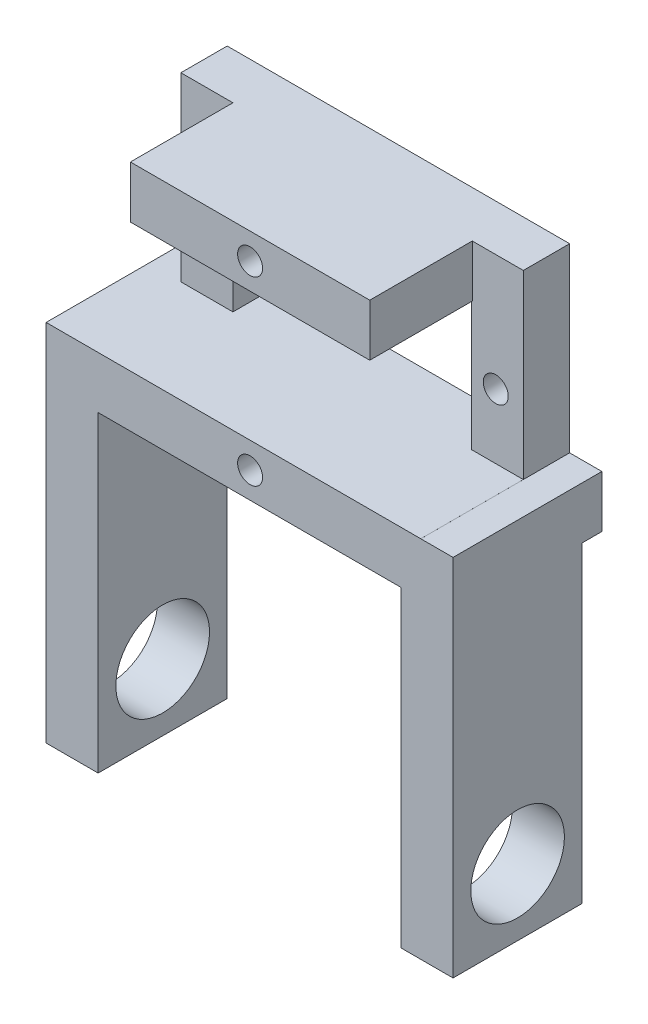
ISO-10303-21;
HEADER;
FILE_DESCRIPTION(('STEP AP214'),'2;1');
FILE_NAME('part.step','',(''),(''),'','','');
FILE_SCHEMA(('AUTOMOTIVE_DESIGN { 1 0 10303 214 1 1 1 1 }'));
ENDSEC;
DATA;
#1=APPLICATION_CONTEXT('core data for automotive mechanical design processes');
#2=APPLICATION_PROTOCOL_DEFINITION('international standard','automotive_design',2000,#1);
#3=PRODUCT_CONTEXT('',#1,'mechanical');
#4=PRODUCT('Part','Part','',(#3));
#5=PRODUCT_RELATED_PRODUCT_CATEGORY('part','',(#4));
#6=PRODUCT_DEFINITION_FORMATION('','',#4);
#7=PRODUCT_DEFINITION_CONTEXT('part definition',#1,'design');
#8=PRODUCT_DEFINITION('design','',#6,#7);
#9=PRODUCT_DEFINITION_SHAPE('','',#8);
#10=(LENGTH_UNIT() NAMED_UNIT(*) SI_UNIT(.MILLI.,.METRE.));
#11=(NAMED_UNIT(*) PLANE_ANGLE_UNIT() SI_UNIT($,.RADIAN.));
#12=(NAMED_UNIT(*) SI_UNIT($,.STERADIAN.) SOLID_ANGLE_UNIT());
#13=UNCERTAINTY_MEASURE_WITH_UNIT(LENGTH_MEASURE(1.E-05),#10,'distance_accuracy_value','');
#14=(GEOMETRIC_REPRESENTATION_CONTEXT(3) GLOBAL_UNCERTAINTY_ASSIGNED_CONTEXT((#13)) GLOBAL_UNIT_ASSIGNED_CONTEXT((#10,
#11,#12)) REPRESENTATION_CONTEXT('',''));
#15=CARTESIAN_POINT('',(0.,0.,0.));
#16=DIRECTION('',(0.,0.,1.));
#17=DIRECTION('',(1.,0.,0.));
#18=AXIS2_PLACEMENT_3D('',#15,#16,#17);
#19=CARTESIAN_POINT('',(-16.45,-11.2,5.));
#20=DIRECTION('',(0.,1.,0.));
#21=DIRECTION('',(0.,0.,1.));
#22=AXIS2_PLACEMENT_3D('',#19,#20,#21);
#23=PLANE('',#22);
#24=DIRECTION('',(0.,0.,-1.));
#25=VECTOR('',#24,1.);
#26=CARTESIAN_POINT('',(14.55,-11.2,2.45));
#27=LINE('',#26,#25);
#28=CARTESIAN_POINT('',(14.55,-11.2,14.85));
#29=VERTEX_POINT('',#28);
#30=CARTESIAN_POINT('',(14.55,-11.2,2.45));
#31=VERTEX_POINT('',#30);
#32=EDGE_CURVE('E487',#29,#31,#27,.T.);
#33=ORIENTED_EDGE('',*,*,#32,.F.);
#34=DIRECTION('',(-1.,0.,0.));
#35=VECTOR('',#34,1.);
#36=CARTESIAN_POINT('',(19.55,-11.2,14.85));
#37=LINE('',#36,#35);
#38=CARTESIAN_POINT('',(-14.55,-11.2,14.85));
#39=VERTEX_POINT('',#38);
#40=EDGE_CURVE('E371',#29,#39,#37,.T.);
#41=ORIENTED_EDGE('',*,*,#40,.T.);
#42=DIRECTION('',(0.,0.,1.));
#43=VECTOR('',#42,1.);
#44=CARTESIAN_POINT('',(-14.55,-11.2,2.45));
#45=LINE('',#44,#43);
#46=CARTESIAN_POINT('',(-14.55,-11.2,2.45));
#47=VERTEX_POINT('',#46);
#48=EDGE_CURVE('E511',#47,#39,#45,.T.);
#49=ORIENTED_EDGE('',*,*,#48,.F.);
#50=DIRECTION('',(1.,0.,0.));
#51=VECTOR('',#50,1.);
#52=CARTESIAN_POINT('',(-14.55,-11.2,2.45));
#53=LINE('',#52,#51);
#54=CARTESIAN_POINT('',(-19.55,-11.2,2.45));
#55=VERTEX_POINT('',#54);
#56=EDGE_CURVE('E505',#55,#47,#53,.T.);
#57=ORIENTED_EDGE('',*,*,#56,.F.);
#58=DIRECTION('',(0.,0.,1.));
#59=VECTOR('',#58,1.);
#60=CARTESIAN_POINT('',(-19.55,-11.2,0.));
#61=LINE('',#60,#59);
#62=CARTESIAN_POINT('',(-19.55,-11.2,0.55));
#63=VERTEX_POINT('',#62);
#64=EDGE_CURVE('E239',#63,#55,#61,.T.);
#65=ORIENTED_EDGE('',*,*,#64,.F.);
#66=DIRECTION('',(-1.,0.,0.));
#67=VECTOR('',#66,1.);
#68=CARTESIAN_POINT('',(19.55,-11.2,0.55));
#69=LINE('',#68,#67);
#70=CARTESIAN_POINT('',(19.55,-11.2,0.55));
#71=VERTEX_POINT('',#70);
#72=EDGE_CURVE('E221',#71,#63,#69,.T.);
#73=ORIENTED_EDGE('',*,*,#72,.F.);
#74=DIRECTION('',(0.,0.,-1.));
#75=VECTOR('',#74,1.);
#76=CARTESIAN_POINT('',(19.55,-11.2,17.3));
#77=LINE('',#76,#75);
#78=CARTESIAN_POINT('',(19.55,-11.2,2.45));
#79=VERTEX_POINT('',#78);
#80=EDGE_CURVE('E237',#79,#71,#77,.T.);
#81=ORIENTED_EDGE('',*,*,#80,.F.);
#82=DIRECTION('',(1.,0.,0.));
#83=VECTOR('',#82,1.);
#84=CARTESIAN_POINT('',(14.55,-11.2,2.45));
#85=LINE('',#84,#83);
#86=EDGE_CURVE('E478',#31,#79,#85,.T.);
#87=ORIENTED_EDGE('',*,*,#86,.F.);
#88=EDGE_LOOP('',(#33,#41,#49,#57,#65,#73,#81,#87));
#89=FACE_BOUND('',#88,.T.);
#90=ADVANCED_FACE('F40',(#89),#23,.F.);
#91=CARTESIAN_POINT('',(-16.45,11.2,5.));
#92=DIRECTION('',(1.,0.,0.));
#93=DIRECTION('',(0.,1.,0.));
#94=AXIS2_PLACEMENT_3D('',#91,#92,#93);
#95=PLANE('',#94);
#96=DIRECTION('',(0.,0.,-1.));
#97=VECTOR('',#96,1.);
#98=CARTESIAN_POINT('',(-16.45,11.2,5.));
#99=LINE('',#98,#97);
#100=CARTESIAN_POINT('',(-16.45,11.2,5.));
#101=VERTEX_POINT('',#100);
#102=CARTESIAN_POINT('',(-16.45,11.2,0.55));
#103=VERTEX_POINT('',#102);
#104=EDGE_CURVE('E344',#101,#103,#99,.T.);
#105=ORIENTED_EDGE('',*,*,#104,.T.);
#106=DIRECTION('',(0.,-1.,0.));
#107=VECTOR('',#106,1.);
#108=CARTESIAN_POINT('',(-16.45,11.2,0.55));
#109=LINE('',#108,#107);
#110=CARTESIAN_POINT('',(-16.45,-6.2,0.55));
#111=VERTEX_POINT('',#110);
#112=EDGE_CURVE('E391',#103,#111,#109,.T.);
#113=ORIENTED_EDGE('',*,*,#112,.T.);
#114=DIRECTION('',(0.,0.,-1.));
#115=VECTOR('',#114,1.);
#116=CARTESIAN_POINT('',(-16.45,-6.2,0.));
#117=LINE('',#116,#115);
#118=CARTESIAN_POINT('',(-16.45,-6.20000000000001,5.));
#119=VERTEX_POINT('',#118);
#120=EDGE_CURVE('E11',#119,#111,#117,.T.);
#121=ORIENTED_EDGE('',*,*,#120,.F.);
#122=DIRECTION('',(0.,-1.,0.));
#123=VECTOR('',#122,1.);
#124=CARTESIAN_POINT('',(-16.45,11.2,5.));
#125=LINE('',#124,#123);
#126=EDGE_CURVE('E340',#101,#119,#125,.T.);
#127=ORIENTED_EDGE('',*,*,#126,.F.);
#128=EDGE_LOOP('',(#105,#113,#121,#127));
#129=FACE_BOUND('',#128,.T.);
#130=ADVANCED_FACE('F579',(#129),#95,.F.);
#131=CARTESIAN_POINT('',(16.45,11.2,5.));
#132=DIRECTION('',(-1.,0.,0.));
#133=DIRECTION('',(0.,0.,1.));
#134=AXIS2_PLACEMENT_3D('',#131,#132,#133);
#135=PLANE('',#134);
#136=DIRECTION('',(0.,0.,-1.));
#137=VECTOR('',#136,1.);
#138=CARTESIAN_POINT('',(16.45,-6.2,17.3));
#139=LINE('',#138,#137);
#140=CARTESIAN_POINT('',(16.45,-6.2,14.85));
#141=VERTEX_POINT('',#140);
#142=CARTESIAN_POINT('',(16.45,-6.2,5.));
#143=VERTEX_POINT('',#142);
#144=EDGE_CURVE('E254',#141,#143,#139,.T.);
#145=ORIENTED_EDGE('',*,*,#144,.F.);
#146=DIRECTION('',(0.,-1.,0.));
#147=VECTOR('',#146,1.);
#148=CARTESIAN_POINT('',(16.45,11.2,14.85));
#149=LINE('',#148,#147);
#150=CARTESIAN_POINT('',(16.45,-6.20179511261654,14.85));
#151=VERTEX_POINT('',#150);
#152=EDGE_CURVE('E399',#141,#151,#149,.T.);
#153=ORIENTED_EDGE('',*,*,#152,.T.);
#154=DIRECTION('',(0.,0.,1.));
#155=VECTOR('',#154,1.);
#156=CARTESIAN_POINT('',(16.45,-6.20179511261654,17.3));
#157=LINE('',#156,#155);
#158=CARTESIAN_POINT('',(16.45,-6.20179511261654,0.549999999999998));
#159=VERTEX_POINT('',#158);
#160=EDGE_CURVE('E250',#159,#151,#157,.T.);
#161=ORIENTED_EDGE('',*,*,#160,.F.);
#162=DIRECTION('',(0.,1.,0.));
#163=VECTOR('',#162,1.);
#164=CARTESIAN_POINT('',(16.45,11.2,0.55));
#165=LINE('',#164,#163);
#166=CARTESIAN_POINT('',(16.45,11.2,0.55));
#167=VERTEX_POINT('',#166);
#168=EDGE_CURVE('E361',#159,#167,#165,.T.);
#169=ORIENTED_EDGE('',*,*,#168,.T.);
#170=DIRECTION('',(0.,0.,-1.));
#171=VECTOR('',#170,1.);
#172=CARTESIAN_POINT('',(16.45,11.2,5.));
#173=LINE('',#172,#171);
#174=CARTESIAN_POINT('',(16.45,11.2,5.));
#175=VERTEX_POINT('',#174);
#176=EDGE_CURVE('E287',#175,#167,#173,.T.);
#177=ORIENTED_EDGE('',*,*,#176,.F.);
#178=DIRECTION('',(0.,1.,0.));
#179=VECTOR('',#178,1.);
#180=CARTESIAN_POINT('',(16.45,11.2,5.));
#181=LINE('',#180,#179);
#182=EDGE_CURVE('E324',#143,#175,#181,.T.);
#183=ORIENTED_EDGE('',*,*,#182,.F.);
#184=EDGE_LOOP('',(#145,#153,#161,#169,#177,#183));
#185=FACE_BOUND('',#184,.T.);
#186=ADVANCED_FACE('F42',(#185),#135,.F.);
#187=CARTESIAN_POINT('',(0.,0.,5.));
#188=DIRECTION('',(0.,0.,1.));
#189=DIRECTION('',(1.,0.,0.));
#190=AXIS2_PLACEMENT_3D('',#187,#188,#189);
#191=PLANE('',#190);
#192=CARTESIAN_POINT('',(13.8,0.,5.));
#193=DIRECTION('',(0.,0.,1.));
#194=DIRECTION('',(1.,0.,0.));
#195=AXIS2_PLACEMENT_3D('',#192,#193,#194);
#196=CIRCLE('',#195,1.2);
#197=CARTESIAN_POINT('',(15.,0.,5.));
#198=VERTEX_POINT('',#197);
#199=EDGE_CURVE('E305',#198,#198,#196,.T.);
#200=ORIENTED_EDGE('',*,*,#199,.F.);
#201=EDGE_LOOP('',(#200));
#202=FACE_BOUND('',#201,.T.);
#203=DIRECTION('',(-1.,0.,0.));
#204=VECTOR('',#203,1.);
#205=CARTESIAN_POINT('',(-11.45,-6.2,5.));
#206=LINE('',#205,#204);
#207=CARTESIAN_POINT('',(11.45,-6.2,5.));
#208=VERTEX_POINT('',#207);
#209=EDGE_CURVE('E272',#143,#208,#206,.T.);
#210=ORIENTED_EDGE('',*,*,#209,.F.);
#211=ORIENTED_EDGE('',*,*,#182,.T.);
#212=DIRECTION('',(-1.,0.,0.));
#213=VECTOR('',#212,1.);
#214=CARTESIAN_POINT('',(-16.45,11.2,5.));
#215=LINE('',#214,#213);
#216=CARTESIAN_POINT('',(11.546888994161,11.2,5.));
#217=VERTEX_POINT('',#216);
#218=EDGE_CURVE('E336',#175,#217,#215,.T.);
#219=ORIENTED_EDGE('',*,*,#218,.T.);
#220=DIRECTION('',(0.,1.,0.));
#221=VECTOR('',#220,1.);
#222=CARTESIAN_POINT('',(11.546888994161,6.2,5.));
#223=LINE('',#222,#221);
#224=CARTESIAN_POINT('',(11.546888994161,6.2,5.));
#225=VERTEX_POINT('',#224);
#226=EDGE_CURVE('E283',#225,#217,#223,.T.);
#227=ORIENTED_EDGE('',*,*,#226,.F.);
#228=DIRECTION('',(1.,0.,0.));
#229=VECTOR('',#228,1.);
#230=CARTESIAN_POINT('',(-11.45,6.2,5.));
#231=LINE('',#230,#229);
#232=CARTESIAN_POINT('',(11.45,6.2,5.));
#233=VERTEX_POINT('',#232);
#234=EDGE_CURVE('E50',#233,#225,#231,.T.);
#235=ORIENTED_EDGE('',*,*,#234,.F.);
#236=DIRECTION('',(0.,1.,0.));
#237=VECTOR('',#236,1.);
#238=CARTESIAN_POINT('',(11.45,6.2,5.));
#239=LINE('',#238,#237);
#240=EDGE_CURVE('E309',#208,#233,#239,.T.);
#241=ORIENTED_EDGE('',*,*,#240,.F.);
#242=EDGE_LOOP('',(#210,#211,#219,#227,#235,#241));
#243=FACE_BOUND('',#242,.T.);
#244=ADVANCED_FACE('F598',(#202,#243),#191,.T.);
#245=CARTESIAN_POINT('',(-13.8,0.,5.));
#246=DIRECTION('',(0.,0.,1.));
#247=DIRECTION('',(1.,0.,0.));
#248=AXIS2_PLACEMENT_3D('',#245,#246,#247);
#249=CIRCLE('',#248,1.2);
#250=CARTESIAN_POINT('',(-12.6,0.,5.));
#251=VERTEX_POINT('',#250);
#252=EDGE_CURVE('E304',#251,#251,#249,.T.);
#253=ORIENTED_EDGE('',*,*,#252,.F.);
#254=EDGE_LOOP('',(#253));
#255=FACE_BOUND('',#254,.T.);
#256=ORIENTED_EDGE('',*,*,#126,.T.);
#257=DIRECTION('',(-1.,0.,0.));
#258=VECTOR('',#257,1.);
#259=CARTESIAN_POINT('',(-16.45,-6.20000000000001,5.));
#260=LINE('',#259,#258);
#261=CARTESIAN_POINT('',(-11.45,-6.20000000000001,5.));
#262=VERTEX_POINT('',#261);
#263=EDGE_CURVE('E263',#262,#119,#260,.T.);
#264=ORIENTED_EDGE('',*,*,#263,.F.);
#265=DIRECTION('',(0.,-1.,0.));
#266=VECTOR('',#265,1.);
#267=CARTESIAN_POINT('',(-11.45,6.2,5.));
#268=LINE('',#267,#266);
#269=CARTESIAN_POINT('',(-11.45,6.2,5.));
#270=VERTEX_POINT('',#269);
#271=EDGE_CURVE('E316',#270,#262,#268,.T.);
#272=ORIENTED_EDGE('',*,*,#271,.F.);
#273=DIRECTION('',(0.,-1.,0.));
#274=VECTOR('',#273,1.);
#275=CARTESIAN_POINT('',(-11.45,6.2,5.));
#276=LINE('',#275,#274);
#277=CARTESIAN_POINT('',(-11.45,11.2,5.));
#278=VERTEX_POINT('',#277);
#279=EDGE_CURVE('E279',#278,#270,#276,.T.);
#280=ORIENTED_EDGE('',*,*,#279,.F.);
#281=EDGE_CURVE('E335',#278,#101,#215,.T.);
#282=ORIENTED_EDGE('',*,*,#281,.T.);
#283=EDGE_LOOP('',(#256,#264,#272,#280,#282));
#284=FACE_BOUND('',#283,.T.);
#285=ADVANCED_FACE('F588',(#255,#284),#191,.T.);
#286=CARTESIAN_POINT('',(-16.45,11.2,5.));
#287=DIRECTION('',(0.,-1.,0.));
#288=DIRECTION('',(0.,0.,-1.));
#289=AXIS2_PLACEMENT_3D('',#286,#287,#288);
#290=PLANE('',#289);
#291=DIRECTION('',(0.,0.,-1.));
#292=VECTOR('',#291,1.);
#293=CARTESIAN_POINT('',(-11.45,11.2,17.3));
#294=LINE('',#293,#292);
#295=CARTESIAN_POINT('',(-11.45,11.2,14.85));
#296=VERTEX_POINT('',#295);
#297=EDGE_CURVE('E291',#296,#278,#294,.T.);
#298=ORIENTED_EDGE('',*,*,#297,.F.);
#299=DIRECTION('',(-1.,0.,0.));
#300=VECTOR('',#299,1.);
#301=CARTESIAN_POINT('',(19.55,11.2,14.85));
#302=LINE('',#301,#300);
#303=CARTESIAN_POINT('',(11.546888994161,11.2,14.85));
#304=VERTEX_POINT('',#303);
#305=EDGE_CURVE('E620',#304,#296,#302,.T.);
#306=ORIENTED_EDGE('',*,*,#305,.F.);
#307=DIRECTION('',(0.,0.,-1.));
#308=VECTOR('',#307,1.);
#309=CARTESIAN_POINT('',(11.546888994161,11.2,17.3));
#310=LINE('',#309,#308);
#311=EDGE_CURVE('E294',#304,#217,#310,.T.);
#312=ORIENTED_EDGE('',*,*,#311,.T.);
#313=ORIENTED_EDGE('',*,*,#218,.F.);
#314=ORIENTED_EDGE('',*,*,#176,.T.);
#315=DIRECTION('',(-1.,0.,0.));
#316=VECTOR('',#315,1.);
#317=CARTESIAN_POINT('',(19.55,11.2,0.55));
#318=LINE('',#317,#316);
#319=EDGE_CURVE('E241',#167,#103,#318,.T.);
#320=ORIENTED_EDGE('',*,*,#319,.T.);
#321=ORIENTED_EDGE('',*,*,#104,.F.);
#322=ORIENTED_EDGE('',*,*,#281,.F.);
#323=EDGE_LOOP('',(#298,#306,#312,#313,#314,#320,#321,#322));
#324=FACE_BOUND('',#323,.T.);
#325=ADVANCED_FACE('F354',(#324),#290,.F.);
#326=CARTESIAN_POINT('',(11.45,6.2,0.));
#327=DIRECTION('',(1.,0.,0.));
#328=DIRECTION('',(0.,0.,-1.));
#329=AXIS2_PLACEMENT_3D('',#326,#327,#328);
#330=PLANE('',#329);
#331=DIRECTION('',(0.,0.,1.));
#332=VECTOR('',#331,1.);
#333=CARTESIAN_POINT('',(11.45,6.2,0.));
#334=LINE('',#333,#332);
#335=CARTESIAN_POINT('',(11.45,6.2,0.55));
#336=VERTEX_POINT('',#335);
#337=EDGE_CURVE('E320',#336,#233,#334,.T.);
#338=ORIENTED_EDGE('',*,*,#337,.F.);
#339=DIRECTION('',(0.,-1.,0.));
#340=VECTOR('',#339,1.);
#341=CARTESIAN_POINT('',(11.45,6.2,0.55));
#342=LINE('',#341,#340);
#343=CARTESIAN_POINT('',(11.45,-6.2,0.55));
#344=VERTEX_POINT('',#343);
#345=EDGE_CURVE('E58',#336,#344,#342,.T.);
#346=ORIENTED_EDGE('',*,*,#345,.T.);
#347=DIRECTION('',(0.,0.,1.));
#348=VECTOR('',#347,1.);
#349=CARTESIAN_POINT('',(11.45,-6.2,0.));
#350=LINE('',#349,#348);
#351=EDGE_CURVE('E321',#344,#208,#350,.T.);
#352=ORIENTED_EDGE('',*,*,#351,.T.);
#353=ORIENTED_EDGE('',*,*,#240,.T.);
#354=EDGE_LOOP('',(#338,#346,#352,#353));
#355=FACE_BOUND('',#354,.T.);
#356=ADVANCED_FACE('F591',(#355),#330,.F.);
#357=CARTESIAN_POINT('',(-11.45,-6.2,0.));
#358=DIRECTION('',(0.,-1.,0.));
#359=DIRECTION('',(0.,0.,-1.));
#360=AXIS2_PLACEMENT_3D('',#357,#358,#359);
#361=PLANE('',#360);
#362=DIRECTION('',(0.,0.,-1.));
#363=VECTOR('',#362,1.);
#364=CARTESIAN_POINT('',(-19.55,-6.2,0.));
#365=LINE('',#364,#363);
#366=CARTESIAN_POINT('',(-19.55,-6.2,14.85));
#367=VERTEX_POINT('',#366);
#368=CARTESIAN_POINT('',(-19.55,-6.2,0.55));
#369=VERTEX_POINT('',#368);
#370=EDGE_CURVE('E257',#367,#369,#365,.T.);
#371=ORIENTED_EDGE('',*,*,#370,.F.);
#372=DIRECTION('',(1.,0.,0.));
#373=VECTOR('',#372,1.);
#374=CARTESIAN_POINT('',(-11.45,-6.2,14.85));
#375=LINE('',#374,#373);
#376=EDGE_CURVE('E402',#367,#141,#375,.T.);
#377=ORIENTED_EDGE('',*,*,#376,.T.);
#378=ORIENTED_EDGE('',*,*,#144,.T.);
#379=ORIENTED_EDGE('',*,*,#209,.T.);
#380=ORIENTED_EDGE('',*,*,#351,.F.);
#381=DIRECTION('',(-1.,0.,0.));
#382=VECTOR('',#381,1.);
#383=CARTESIAN_POINT('',(-11.45,-6.2,0.55));
#384=LINE('',#383,#382);
#385=CARTESIAN_POINT('',(-11.45,-6.2,0.55));
#386=VERTEX_POINT('',#385);
#387=EDGE_CURVE('E384',#344,#386,#384,.T.);
#388=ORIENTED_EDGE('',*,*,#387,.T.);
#389=DIRECTION('',(0.,0.,1.));
#390=VECTOR('',#389,1.);
#391=CARTESIAN_POINT('',(-11.45,-6.2,0.));
#392=LINE('',#391,#390);
#393=EDGE_CURVE('E325',#386,#262,#392,.T.);
#394=ORIENTED_EDGE('',*,*,#393,.T.);
#395=ORIENTED_EDGE('',*,*,#263,.T.);
#396=ORIENTED_EDGE('',*,*,#120,.T.);
#397=EDGE_CURVE('E388',#111,#369,#384,.T.);
#398=ORIENTED_EDGE('',*,*,#397,.T.);
#399=EDGE_LOOP('',(#371,#377,#378,#379,#380,#388,#394,#395,#396,#398));
#400=FACE_BOUND('',#399,.T.);
#401=ADVANCED_FACE('F552',(#400),#361,.F.);
#402=CARTESIAN_POINT('',(-11.45,6.2,0.));
#403=DIRECTION('',(-1.,0.,0.));
#404=DIRECTION('',(0.,0.,1.));
#405=AXIS2_PLACEMENT_3D('',#402,#403,#404);
#406=PLANE('',#405);
#407=ORIENTED_EDGE('',*,*,#393,.F.);
#408=DIRECTION('',(0.,1.,0.));
#409=VECTOR('',#408,1.);
#410=CARTESIAN_POINT('',(-11.45,6.2,0.55));
#411=LINE('',#410,#409);
#412=CARTESIAN_POINT('',(-11.45,6.2,0.55));
#413=VERTEX_POINT('',#412);
#414=EDGE_CURVE('E380',#386,#413,#411,.T.);
#415=ORIENTED_EDGE('',*,*,#414,.T.);
#416=DIRECTION('',(0.,0.,1.));
#417=VECTOR('',#416,1.);
#418=CARTESIAN_POINT('',(-11.45,6.2,0.));
#419=LINE('',#418,#417);
#420=EDGE_CURVE('E328',#413,#270,#419,.T.);
#421=ORIENTED_EDGE('',*,*,#420,.T.);
#422=ORIENTED_EDGE('',*,*,#271,.T.);
#423=EDGE_LOOP('',(#407,#415,#421,#422));
#424=FACE_BOUND('',#423,.T.);
#425=ADVANCED_FACE('F614',(#424),#406,.F.);
#426=CARTESIAN_POINT('',(-11.45,6.2,0.));
#427=DIRECTION('',(0.,1.,0.));
#428=DIRECTION('',(0.,0.,1.));
#429=AXIS2_PLACEMENT_3D('',#426,#427,#428);
#430=PLANE('',#429);
#431=DIRECTION('',(0.,0.,-1.));
#432=VECTOR('',#431,1.);
#433=CARTESIAN_POINT('',(11.546888994161,6.2,17.3));
#434=LINE('',#433,#432);
#435=CARTESIAN_POINT('',(11.546888994161,6.2,14.85));
#436=VERTEX_POINT('',#435);
#437=EDGE_CURVE('E297',#436,#225,#434,.T.);
#438=ORIENTED_EDGE('',*,*,#437,.F.);
#439=DIRECTION('',(-1.,0.,0.));
#440=VECTOR('',#439,1.);
#441=CARTESIAN_POINT('',(-11.45,6.2,14.85));
#442=LINE('',#441,#440);
#443=CARTESIAN_POINT('',(-11.45,6.2,14.85));
#444=VERTEX_POINT('',#443);
#445=EDGE_CURVE('E66',#436,#444,#442,.T.);
#446=ORIENTED_EDGE('',*,*,#445,.T.);
#447=DIRECTION('',(0.,0.,-1.));
#448=VECTOR('',#447,1.);
#449=CARTESIAN_POINT('',(-11.45,6.2,17.3));
#450=LINE('',#449,#448);
#451=EDGE_CURVE('E300',#444,#270,#450,.T.);
#452=ORIENTED_EDGE('',*,*,#451,.T.);
#453=ORIENTED_EDGE('',*,*,#420,.F.);
#454=DIRECTION('',(1.,0.,0.));
#455=VECTOR('',#454,1.);
#456=CARTESIAN_POINT('',(-11.45,6.2,0.55));
#457=LINE('',#456,#455);
#458=EDGE_CURVE('E377',#413,#336,#457,.T.);
#459=ORIENTED_EDGE('',*,*,#458,.T.);
#460=ORIENTED_EDGE('',*,*,#337,.T.);
#461=ORIENTED_EDGE('',*,*,#234,.T.);
#462=EDGE_LOOP('',(#438,#446,#452,#453,#459,#460,#461));
#463=FACE_BOUND('',#462,.T.);
#464=ADVANCED_FACE('F634',(#463),#430,.F.);
#465=CARTESIAN_POINT('',(13.8,0.,0.));
#466=DIRECTION('',(0.,0.,1.));
#467=DIRECTION('',(1.,0.,0.));
#468=AXIS2_PLACEMENT_3D('',#465,#466,#467);
#469=CYLINDRICAL_SURFACE('',#468,1.2);
#470=CARTESIAN_POINT('',(13.8,0.,0.55));
#471=DIRECTION('',(0.,0.,1.));
#472=DIRECTION('',(1.,0.,0.));
#473=AXIS2_PLACEMENT_3D('',#470,#471,#472);
#474=CIRCLE('',#473,1.2);
#475=CARTESIAN_POINT('',(15.,0.,0.55));
#476=VERTEX_POINT('',#475);
#477=EDGE_CURVE('E369',#476,#476,#474,.F.);
#478=ORIENTED_EDGE('',*,*,#477,.T.);
#479=EDGE_LOOP('',(#478));
#480=FACE_BOUND('',#479,.T.);
#481=ORIENTED_EDGE('',*,*,#199,.T.);
#482=EDGE_LOOP('',(#481));
#483=FACE_BOUND('',#482,.T.);
#484=ADVANCED_FACE('F700',(#480,#483),#469,.F.);
#485=CARTESIAN_POINT('',(-13.8,0.,0.));
#486=DIRECTION('',(0.,0.,1.));
#487=DIRECTION('',(1.,0.,0.));
#488=AXIS2_PLACEMENT_3D('',#485,#486,#487);
#489=CYLINDRICAL_SURFACE('',#488,1.2);
#490=CARTESIAN_POINT('',(-13.8,0.,0.55));
#491=DIRECTION('',(0.,0.,1.));
#492=DIRECTION('',(1.,0.,0.));
#493=AXIS2_PLACEMENT_3D('',#490,#491,#492);
#494=CIRCLE('',#493,1.2);
#495=CARTESIAN_POINT('',(-12.6,0.,0.55));
#496=VERTEX_POINT('',#495);
#497=EDGE_CURVE('E364',#496,#496,#494,.F.);
#498=ORIENTED_EDGE('',*,*,#497,.T.);
#499=EDGE_LOOP('',(#498));
#500=FACE_BOUND('',#499,.T.);
#501=ORIENTED_EDGE('',*,*,#252,.T.);
#502=EDGE_LOOP('',(#501));
#503=FACE_BOUND('',#502,.T.);
#504=ADVANCED_FACE('F699',(#500,#503),#489,.F.);
#505=CARTESIAN_POINT('',(-11.45,6.2,17.3));
#506=DIRECTION('',(1.,0.,0.));
#507=DIRECTION('',(0.,0.,-1.));
#508=AXIS2_PLACEMENT_3D('',#505,#506,#507);
#509=PLANE('',#508);
#510=ORIENTED_EDGE('',*,*,#451,.F.);
#511=DIRECTION('',(0.,1.,0.));
#512=VECTOR('',#511,1.);
#513=CARTESIAN_POINT('',(-11.45,6.2,14.85));
#514=LINE('',#513,#512);
#515=EDGE_CURVE('E419',#444,#296,#514,.T.);
#516=ORIENTED_EDGE('',*,*,#515,.T.);
#517=ORIENTED_EDGE('',*,*,#297,.T.);
#518=ORIENTED_EDGE('',*,*,#279,.T.);
#519=EDGE_LOOP('',(#510,#516,#517,#518));
#520=FACE_BOUND('',#519,.T.);
#521=ADVANCED_FACE('F618',(#520),#509,.F.);
#522=CARTESIAN_POINT('',(11.546888994161,6.2,17.3));
#523=DIRECTION('',(-1.,0.,0.));
#524=DIRECTION('',(0.,0.,1.));
#525=AXIS2_PLACEMENT_3D('',#522,#523,#524);
#526=PLANE('',#525);
#527=ORIENTED_EDGE('',*,*,#311,.F.);
#528=DIRECTION('',(0.,-1.,0.));
#529=VECTOR('',#528,1.);
#530=CARTESIAN_POINT('',(11.546888994161,6.2,14.85));
#531=LINE('',#530,#529);
#532=EDGE_CURVE('E414',#304,#436,#531,.T.);
#533=ORIENTED_EDGE('',*,*,#532,.T.);
#534=ORIENTED_EDGE('',*,*,#437,.T.);
#535=ORIENTED_EDGE('',*,*,#226,.T.);
#536=EDGE_LOOP('',(#527,#533,#534,#535));
#537=FACE_BOUND('',#536,.T.);
#538=ADVANCED_FACE('F626',(#537),#526,.F.);
#539=CARTESIAN_POINT('',(19.55,-6.20179511261654,17.3));
#540=DIRECTION('',(0.,-1.,0.));
#541=DIRECTION('',(1.,0.,0.));
#542=AXIS2_PLACEMENT_3D('',#539,#540,#541);
#543=PLANE('',#542);
#544=ORIENTED_EDGE('',*,*,#160,.T.);
#545=DIRECTION('',(1.,0.,0.));
#546=VECTOR('',#545,1.);
#547=CARTESIAN_POINT('',(19.55,-6.20179511261654,14.85));
#548=LINE('',#547,#546);
#549=CARTESIAN_POINT('',(19.55,-6.20179511261654,14.85));
#550=VERTEX_POINT('',#549);
#551=EDGE_CURVE('E395',#151,#550,#548,.T.);
#552=ORIENTED_EDGE('',*,*,#551,.T.);
#553=DIRECTION('',(0.,0.,1.));
#554=VECTOR('',#553,1.);
#555=CARTESIAN_POINT('',(19.55,-6.20179511261654,17.3));
#556=LINE('',#555,#554);
#557=CARTESIAN_POINT('',(19.55,-6.20179511261654,0.55));
#558=VERTEX_POINT('',#557);
#559=EDGE_CURVE('E249',#558,#550,#556,.T.);
#560=ORIENTED_EDGE('',*,*,#559,.F.);
#561=DIRECTION('',(-1.,0.,0.));
#562=VECTOR('',#561,1.);
#563=CARTESIAN_POINT('',(19.55,-6.20179511261654,0.549999999999998));
#564=LINE('',#563,#562);
#565=EDGE_CURVE('E224',#558,#159,#564,.T.);
#566=ORIENTED_EDGE('',*,*,#565,.T.);
#567=EDGE_LOOP('',(#544,#552,#560,#566));
#568=FACE_BOUND('',#567,.T.);
#569=ADVANCED_FACE('F638',(#568),#543,.F.);
#570=CARTESIAN_POINT('',(19.55,0.,0.));
#571=DIRECTION('',(-1.,0.,0.));
#572=DIRECTION('',(0.,0.,1.));
#573=AXIS2_PLACEMENT_3D('',#570,#571,#572);
#574=PLANE('',#573);
#575=CARTESIAN_POINT('',(19.55,-34.8,8.65));
#576=DIRECTION('',(1.,0.,0.));
#577=DIRECTION('',(0.,0.,-1.));
#578=AXIS2_PLACEMENT_3D('',#575,#576,#577);
#579=CIRCLE('',#578,4.5);
#580=CARTESIAN_POINT('',(19.55,-34.8,4.15));
#581=VERTEX_POINT('',#580);
#582=EDGE_CURVE('E469',#581,#581,#579,.T.);
#583=ORIENTED_EDGE('',*,*,#582,.F.);
#584=EDGE_LOOP('',(#583));
#585=FACE_BOUND('',#584,.T.);
#586=ORIENTED_EDGE('',*,*,#559,.T.);
#587=DIRECTION('',(0.,1.,0.));
#588=VECTOR('',#587,1.);
#589=CARTESIAN_POINT('',(19.55,-41.2,14.85));
#590=LINE('',#589,#588);
#591=CARTESIAN_POINT('',(19.55,-41.2,14.85));
#592=VERTEX_POINT('',#591);
#593=EDGE_CURVE('E502',#592,#550,#590,.T.);
#594=ORIENTED_EDGE('',*,*,#593,.F.);
#595=DIRECTION('',(0.,0.,1.));
#596=VECTOR('',#595,1.);
#597=CARTESIAN_POINT('',(19.55,-41.2,2.45));
#598=LINE('',#597,#596);
#599=CARTESIAN_POINT('',(19.55,-41.2,2.45));
#600=VERTEX_POINT('',#599);
#601=EDGE_CURVE('E473',#600,#592,#598,.T.);
#602=ORIENTED_EDGE('',*,*,#601,.F.);
#603=DIRECTION('',(0.,1.,0.));
#604=VECTOR('',#603,1.);
#605=CARTESIAN_POINT('',(19.55,-41.2,2.45));
#606=LINE('',#605,#604);
#607=EDGE_CURVE('E246',#600,#79,#606,.T.);
#608=ORIENTED_EDGE('',*,*,#607,.T.);
#609=ORIENTED_EDGE('',*,*,#80,.T.);
#610=DIRECTION('',(0.,1.,0.));
#611=VECTOR('',#610,1.);
#612=CARTESIAN_POINT('',(19.55,-11.2,0.55));
#613=LINE('',#612,#611);
#614=EDGE_CURVE('E218',#71,#558,#613,.T.);
#615=ORIENTED_EDGE('',*,*,#614,.T.);
#616=EDGE_LOOP('',(#586,#594,#602,#608,#609,#615));
#617=FACE_BOUND('',#616,.T.);
#618=ADVANCED_FACE('F243',(#585,#617),#574,.F.);
#619=CARTESIAN_POINT('',(-19.55,0.,0.));
#620=DIRECTION('',(1.,0.,0.));
#621=DIRECTION('',(0.,0.,-1.));
#622=AXIS2_PLACEMENT_3D('',#619,#620,#621);
#623=PLANE('',#622);
#624=CARTESIAN_POINT('',(-19.55,-22.3,8.65));
#625=DIRECTION('',(-1.,0.,0.));
#626=DIRECTION('',(0.,0.,1.));
#627=AXIS2_PLACEMENT_3D('',#624,#625,#626);
#628=CIRCLE('',#627,3.);
#629=CARTESIAN_POINT('',(-19.55,-22.3,11.65));
#630=VERTEX_POINT('',#629);
#631=CARTESIAN_POINT('',(-19.55,-22.3,5.65));
#632=VERTEX_POINT('',#631);
#633=EDGE_CURVE('E423',#630,#632,#628,.T.);
#634=ORIENTED_EDGE('',*,*,#633,.F.);
#635=DIRECTION('',(0.,0.995620833149108,-0.0934834562876054));
#636=VECTOR('',#635,1.);
#637=CARTESIAN_POINT('',(-19.55,-32.6920796755427,12.625760544316));
#638=LINE('',#637,#636);
#639=CARTESIAN_POINT('',(-19.55,-32.6920796755427,12.625760544316));
#640=VERTEX_POINT('',#639);
#641=EDGE_CURVE('E429',#640,#630,#638,.T.);
#642=ORIENTED_EDGE('',*,*,#641,.F.);
#643=CARTESIAN_POINT('',(-19.55,-34.8,8.65));
#644=DIRECTION('',(1.,0.,0.));
#645=DIRECTION('',(0.,0.,-1.));
#646=AXIS2_PLACEMENT_3D('',#643,#644,#645);
#647=CIRCLE('',#646,4.5);
#648=CARTESIAN_POINT('',(-19.55,-32.6920796755427,4.67423945568402));
#649=VERTEX_POINT('',#648);
#650=EDGE_CURVE('E465',#640,#649,#647,.T.);
#651=ORIENTED_EDGE('',*,*,#650,.T.);
#652=DIRECTION('',(0.,-0.995620833149108,-0.0934834562876052));
#653=VECTOR('',#652,1.);
#654=CARTESIAN_POINT('',(-19.55,-22.3,5.65));
#655=LINE('',#654,#653);
#656=EDGE_CURVE('E443',#632,#649,#655,.T.);
#657=ORIENTED_EDGE('',*,*,#656,.F.);
#658=EDGE_LOOP('',(#634,#642,#651,#657));
#659=FACE_BOUND('',#658,.T.);
#660=DIRECTION('',(0.,1.,0.));
#661=VECTOR('',#660,1.);
#662=CARTESIAN_POINT('',(-19.55,-41.2,14.85));
#663=LINE('',#662,#661);
#664=CARTESIAN_POINT('',(-19.55,-41.2,14.85));
#665=VERTEX_POINT('',#664);
#666=EDGE_CURVE('E520',#665,#367,#663,.T.);
#667=ORIENTED_EDGE('',*,*,#666,.T.);
#668=ORIENTED_EDGE('',*,*,#370,.T.);
#669=DIRECTION('',(0.,1.,0.));
#670=VECTOR('',#669,1.);
#671=CARTESIAN_POINT('',(-19.55,-11.2,0.55));
#672=LINE('',#671,#670);
#673=EDGE_CURVE('E230',#63,#369,#672,.T.);
#674=ORIENTED_EDGE('',*,*,#673,.F.);
#675=ORIENTED_EDGE('',*,*,#64,.T.);
#676=DIRECTION('',(0.,1.,0.));
#677=VECTOR('',#676,1.);
#678=CARTESIAN_POINT('',(-19.55,-41.2,2.45));
#679=LINE('',#678,#677);
#680=CARTESIAN_POINT('',(-19.55,-41.2,2.45));
#681=VERTEX_POINT('',#680);
#682=EDGE_CURVE('E537',#681,#55,#679,.T.);
#683=ORIENTED_EDGE('',*,*,#682,.F.);
#684=DIRECTION('',(0.,0.,-1.));
#685=VECTOR('',#684,1.);
#686=CARTESIAN_POINT('',(-19.55,-41.2,2.45));
#687=LINE('',#686,#685);
#688=EDGE_CURVE('E506',#665,#681,#687,.T.);
#689=ORIENTED_EDGE('',*,*,#688,.F.);
#690=EDGE_LOOP('',(#667,#668,#674,#675,#683,#689));
#691=FACE_BOUND('',#690,.T.);
#692=ADVANCED_FACE('F546',(#659,#691),#623,.F.);
#693=CARTESIAN_POINT('',(-14.55,-41.2,2.45));
#694=DIRECTION('',(0.,0.,1.));
#695=DIRECTION('',(1.,0.,0.));
#696=AXIS2_PLACEMENT_3D('',#693,#694,#695);
#697=PLANE('',#696);
#698=ORIENTED_EDGE('',*,*,#56,.T.);
#699=DIRECTION('',(0.,1.,0.));
#700=VECTOR('',#699,1.);
#701=CARTESIAN_POINT('',(-14.55,-41.2,2.45));
#702=LINE('',#701,#700);
#703=CARTESIAN_POINT('',(-14.55,-41.2,2.45));
#704=VERTEX_POINT('',#703);
#705=EDGE_CURVE('E533',#704,#47,#702,.T.);
#706=ORIENTED_EDGE('',*,*,#705,.F.);
#707=DIRECTION('',(1.,0.,0.));
#708=VECTOR('',#707,1.);
#709=CARTESIAN_POINT('',(-14.55,-41.2,2.45));
#710=LINE('',#709,#708);
#711=EDGE_CURVE('E510',#681,#704,#710,.T.);
#712=ORIENTED_EDGE('',*,*,#711,.F.);
#713=ORIENTED_EDGE('',*,*,#682,.T.);
#714=EDGE_LOOP('',(#698,#706,#712,#713));
#715=FACE_BOUND('',#714,.T.);
#716=ADVANCED_FACE('F665',(#715),#697,.F.);
#717=CARTESIAN_POINT('',(-14.55,-41.2,2.45));
#718=DIRECTION('',(-1.,0.,0.));
#719=DIRECTION('',(0.,0.,1.));
#720=AXIS2_PLACEMENT_3D('',#717,#718,#719);
#721=PLANE('',#720);
#722=CARTESIAN_POINT('',(-14.55,-34.8,8.65));
#723=DIRECTION('',(1.,0.,0.));
#724=DIRECTION('',(0.,0.,-1.));
#725=AXIS2_PLACEMENT_3D('',#722,#723,#724);
#726=CIRCLE('',#725,4.5);
#727=CARTESIAN_POINT('',(-14.55,-34.8,4.15));
#728=VERTEX_POINT('',#727);
#729=EDGE_CURVE('E452',#728,#728,#726,.T.);
#730=ORIENTED_EDGE('',*,*,#729,.F.);
#731=EDGE_LOOP('',(#730));
#732=FACE_BOUND('',#731,.T.);
#733=ORIENTED_EDGE('',*,*,#48,.T.);
#734=DIRECTION('',(0.,1.,0.));
#735=VECTOR('',#734,1.);
#736=CARTESIAN_POINT('',(-14.55,-41.2,14.85));
#737=LINE('',#736,#735);
#738=CARTESIAN_POINT('',(-14.55,-41.2,14.85));
#739=VERTEX_POINT('',#738);
#740=EDGE_CURVE('E529',#739,#39,#737,.T.);
#741=ORIENTED_EDGE('',*,*,#740,.F.);
#742=DIRECTION('',(0.,0.,1.));
#743=VECTOR('',#742,1.);
#744=CARTESIAN_POINT('',(-14.55,-41.2,2.45));
#745=LINE('',#744,#743);
#746=EDGE_CURVE('E514',#704,#739,#745,.T.);
#747=ORIENTED_EDGE('',*,*,#746,.F.);
#748=ORIENTED_EDGE('',*,*,#705,.T.);
#749=EDGE_LOOP('',(#733,#741,#747,#748));
#750=FACE_BOUND('',#749,.T.);
#751=ADVANCED_FACE('F662',(#732,#750),#721,.F.);
#752=CARTESIAN_POINT('',(-14.55,-41.2,14.85));
#753=DIRECTION('',(0.,0.,-1.));
#754=DIRECTION('',(-1.,0.,0.));
#755=AXIS2_PLACEMENT_3D('',#752,#753,#754);
#756=PLANE('',#755);
#757=ORIENTED_EDGE('',*,*,#740,.T.);
#758=ORIENTED_EDGE('',*,*,#40,.F.);
#759=DIRECTION('',(0.,1.,0.));
#760=VECTOR('',#759,1.);
#761=CARTESIAN_POINT('',(14.55,-41.2,14.85));
#762=LINE('',#761,#760);
#763=CARTESIAN_POINT('',(14.55,-41.2,14.85));
#764=VERTEX_POINT('',#763);
#765=EDGE_CURVE('E498',#764,#29,#762,.T.);
#766=ORIENTED_EDGE('',*,*,#765,.F.);
#767=DIRECTION('',(-1.,0.,0.));
#768=VECTOR('',#767,1.);
#769=CARTESIAN_POINT('',(14.55,-41.2,14.85));
#770=LINE('',#769,#768);
#771=EDGE_CURVE('E477',#592,#764,#770,.T.);
#772=ORIENTED_EDGE('',*,*,#771,.F.);
#773=ORIENTED_EDGE('',*,*,#593,.T.);
#774=ORIENTED_EDGE('',*,*,#551,.F.);
#775=ORIENTED_EDGE('',*,*,#152,.F.);
#776=ORIENTED_EDGE('',*,*,#376,.F.);
#777=ORIENTED_EDGE('',*,*,#666,.F.);
#778=DIRECTION('',(-1.,0.,0.));
#779=VECTOR('',#778,1.);
#780=CARTESIAN_POINT('',(-14.55,-41.2,14.85));
#781=LINE('',#780,#779);
#782=EDGE_CURVE('E517',#739,#665,#781,.T.);
#783=ORIENTED_EDGE('',*,*,#782,.F.);
#784=EDGE_LOOP('',(#757,#758,#766,#772,#773,#774,#775,#776,#777,#783));
#785=FACE_BOUND('',#784,.T.);
#786=CARTESIAN_POINT('',(0.0484444970805025,-8.7,14.85));
#787=DIRECTION('',(0.,0.,-1.));
#788=DIRECTION('',(-1.,0.,0.));
#789=AXIS2_PLACEMENT_3D('',#786,#787,#788);
#790=CIRCLE('',#789,1.2);
#791=CARTESIAN_POINT('',(-1.1515555029195,-8.7,14.85));
#792=VERTEX_POINT('',#791);
#793=EDGE_CURVE('E410',#792,#792,#790,.F.);
#794=ORIENTED_EDGE('',*,*,#793,.F.);
#795=EDGE_LOOP('',(#794));
#796=FACE_BOUND('',#795,.T.);
#797=ADVANCED_FACE('F640',(#785,#796),#756,.F.);
#798=CARTESIAN_POINT('',(0.,-41.2,0.));
#799=DIRECTION('',(0.,-1.,0.));
#800=DIRECTION('',(0.,0.,-1.));
#801=AXIS2_PLACEMENT_3D('',#798,#799,#800);
#802=PLANE('',#801);
#803=ORIENTED_EDGE('',*,*,#688,.T.);
#804=ORIENTED_EDGE('',*,*,#711,.T.);
#805=ORIENTED_EDGE('',*,*,#746,.T.);
#806=ORIENTED_EDGE('',*,*,#782,.T.);
#807=EDGE_LOOP('',(#803,#804,#805,#806));
#808=FACE_BOUND('',#807,.T.);
#809=ADVANCED_FACE('F648',(#808),#802,.T.);
#810=CARTESIAN_POINT('',(14.55,-41.2,2.45));
#811=DIRECTION('',(1.,0.,0.));
#812=DIRECTION('',(0.,0.,-1.));
#813=AXIS2_PLACEMENT_3D('',#810,#811,#812);
#814=PLANE('',#813);
#815=CARTESIAN_POINT('',(14.55,-34.8,8.65));
#816=DIRECTION('',(1.,0.,0.));
#817=DIRECTION('',(0.,0.,-1.));
#818=AXIS2_PLACEMENT_3D('',#815,#816,#817);
#819=CIRCLE('',#818,4.5);
#820=CARTESIAN_POINT('',(14.55,-34.8,4.15));
#821=VERTEX_POINT('',#820);
#822=EDGE_CURVE('E44',#821,#821,#819,.T.);
#823=ORIENTED_EDGE('',*,*,#822,.T.);
#824=EDGE_LOOP('',(#823));
#825=FACE_BOUND('',#824,.T.);
#826=ORIENTED_EDGE('',*,*,#32,.T.);
#827=DIRECTION('',(0.,1.,0.));
#828=VECTOR('',#827,1.);
#829=CARTESIAN_POINT('',(14.55,-41.2,2.45));
#830=LINE('',#829,#828);
#831=CARTESIAN_POINT('',(14.55,-41.2,2.45));
#832=VERTEX_POINT('',#831);
#833=EDGE_CURVE('E494',#832,#31,#830,.T.);
#834=ORIENTED_EDGE('',*,*,#833,.F.);
#835=DIRECTION('',(0.,0.,-1.));
#836=VECTOR('',#835,1.);
#837=CARTESIAN_POINT('',(14.55,-41.2,2.45));
#838=LINE('',#837,#836);
#839=EDGE_CURVE('E481',#764,#832,#838,.T.);
#840=ORIENTED_EDGE('',*,*,#839,.F.);
#841=ORIENTED_EDGE('',*,*,#765,.T.);
#842=EDGE_LOOP('',(#826,#834,#840,#841));
#843=FACE_BOUND('',#842,.T.);
#844=ADVANCED_FACE('F558',(#825,#843),#814,.F.);
#845=CARTESIAN_POINT('',(14.55,-41.2,2.45));
#846=DIRECTION('',(0.,0.,1.));
#847=DIRECTION('',(1.,0.,0.));
#848=AXIS2_PLACEMENT_3D('',#845,#846,#847);
#849=PLANE('',#848);
#850=ORIENTED_EDGE('',*,*,#86,.T.);
#851=ORIENTED_EDGE('',*,*,#607,.F.);
#852=DIRECTION('',(1.,0.,0.));
#853=VECTOR('',#852,1.);
#854=CARTESIAN_POINT('',(14.55,-41.2,2.45));
#855=LINE('',#854,#853);
#856=EDGE_CURVE('E484',#832,#600,#855,.T.);
#857=ORIENTED_EDGE('',*,*,#856,.F.);
#858=ORIENTED_EDGE('',*,*,#833,.T.);
#859=EDGE_LOOP('',(#850,#851,#857,#858));
#860=FACE_BOUND('',#859,.T.);
#861=ADVANCED_FACE('F575',(#860),#849,.F.);
#862=CARTESIAN_POINT('',(0.,-41.2,0.));
#863=DIRECTION('',(0.,1.,0.));
#864=DIRECTION('',(0.,0.,1.));
#865=AXIS2_PLACEMENT_3D('',#862,#863,#864);
#866=PLANE('',#865);
#867=ORIENTED_EDGE('',*,*,#601,.T.);
#868=ORIENTED_EDGE('',*,*,#771,.T.);
#869=ORIENTED_EDGE('',*,*,#839,.T.);
#870=ORIENTED_EDGE('',*,*,#856,.T.);
#871=EDGE_LOOP('',(#867,#868,#869,#870));
#872=FACE_BOUND('',#871,.T.);
#873=ADVANCED_FACE('F564',(#872),#866,.F.);
#874=CARTESIAN_POINT('',(9.55,-34.8,8.65));
#875=DIRECTION('',(1.,0.,0.));
#876=DIRECTION('',(0.,0.,-1.));
#877=AXIS2_PLACEMENT_3D('',#874,#875,#876);
#878=CYLINDRICAL_SURFACE('',#877,4.5);
#879=ORIENTED_EDGE('',*,*,#582,.T.);
#880=EDGE_LOOP('',(#879));
#881=FACE_BOUND('',#880,.T.);
#882=ORIENTED_EDGE('',*,*,#822,.F.);
#883=EDGE_LOOP('',(#882));
#884=FACE_BOUND('',#883,.T.);
#885=ADVANCED_FACE('F561',(#881,#884),#878,.F.);
#886=CARTESIAN_POINT('',(-24.55,-34.8,8.65));
#887=DIRECTION('',(1.,0.,0.));
#888=DIRECTION('',(0.,0.,-1.));
#889=AXIS2_PLACEMENT_3D('',#886,#887,#888);
#890=CYLINDRICAL_SURFACE('',#889,4.5);
#891=ORIENTED_EDGE('',*,*,#650,.F.);
#892=DIRECTION('',(-1.,0.,0.));
#893=VECTOR('',#892,1.);
#894=CARTESIAN_POINT('',(-16.55,-32.6920796755427,12.625760544316));
#895=LINE('',#894,#893);
#896=CARTESIAN_POINT('',(-16.55,-32.6920796755427,12.625760544316));
#897=VERTEX_POINT('',#896);
#898=EDGE_CURVE('E453',#897,#640,#895,.T.);
#899=ORIENTED_EDGE('',*,*,#898,.F.);
#900=CARTESIAN_POINT('',(-16.55,-34.8,8.65000000000001));
#901=DIRECTION('',(1.,0.,0.));
#902=DIRECTION('',(0.,0.,-1.));
#903=AXIS2_PLACEMENT_3D('',#900,#901,#902);
#904=CIRCLE('',#903,4.5);
#905=CARTESIAN_POINT('',(-16.55,-32.6920796755427,4.67423945568402));
#906=VERTEX_POINT('',#905);
#907=EDGE_CURVE('E432',#906,#897,#904,.T.);
#908=ORIENTED_EDGE('',*,*,#907,.F.);
#909=DIRECTION('',(-1.,0.,0.));
#910=VECTOR('',#909,1.);
#911=CARTESIAN_POINT('',(-16.55,-32.6920796755427,4.67423945568402));
#912=LINE('',#911,#910);
#913=EDGE_CURVE('E456',#906,#649,#912,.T.);
#914=ORIENTED_EDGE('',*,*,#913,.T.);
#915=EDGE_LOOP('',(#891,#899,#908,#914));
#916=FACE_BOUND('',#915,.T.);
#917=ORIENTED_EDGE('',*,*,#729,.T.);
#918=EDGE_LOOP('',(#917));
#919=FACE_BOUND('',#918,.T.);
#920=ADVANCED_FACE('F563',(#916,#919),#890,.F.);
#921=CARTESIAN_POINT('',(-16.55,-22.3,8.65));
#922=DIRECTION('',(-1.,0.,0.));
#923=DIRECTION('',(0.,0.,1.));
#924=AXIS2_PLACEMENT_3D('',#921,#922,#923);
#925=CYLINDRICAL_SURFACE('',#924,3.);
#926=ORIENTED_EDGE('',*,*,#633,.T.);
#927=DIRECTION('',(-1.,0.,0.));
#928=VECTOR('',#927,1.);
#929=CARTESIAN_POINT('',(-16.55,-22.3,5.65));
#930=LINE('',#929,#928);
#931=CARTESIAN_POINT('',(-16.55,-22.3,5.65));
#932=VERTEX_POINT('',#931);
#933=EDGE_CURVE('E439',#932,#632,#930,.T.);
#934=ORIENTED_EDGE('',*,*,#933,.F.);
#935=CARTESIAN_POINT('',(-16.55,-22.3,8.65));
#936=DIRECTION('',(-1.,0.,0.));
#937=DIRECTION('',(0.,0.,1.));
#938=AXIS2_PLACEMENT_3D('',#935,#936,#937);
#939=CIRCLE('',#938,3.);
#940=CARTESIAN_POINT('',(-16.55,-22.3,11.65));
#941=VERTEX_POINT('',#940);
#942=EDGE_CURVE('E424',#941,#932,#939,.T.);
#943=ORIENTED_EDGE('',*,*,#942,.F.);
#944=DIRECTION('',(-1.,0.,0.));
#945=VECTOR('',#944,1.);
#946=CARTESIAN_POINT('',(-16.55,-22.3,11.65));
#947=LINE('',#946,#945);
#948=EDGE_CURVE('E449',#941,#630,#947,.T.);
#949=ORIENTED_EDGE('',*,*,#948,.T.);
#950=EDGE_LOOP('',(#926,#934,#943,#949));
#951=FACE_BOUND('',#950,.T.);
#952=ADVANCED_FACE('F572',(#951),#925,.F.);
#953=CARTESIAN_POINT('',(-16.55,-32.6920796755427,12.625760544316));
#954=DIRECTION('',(0.,0.0934834562876054,0.995620833149108));
#955=DIRECTION('',(0.,-0.995620833149108,0.0934834562876054));
#956=AXIS2_PLACEMENT_3D('',#953,#954,#955);
#957=PLANE('',#956);
#958=ORIENTED_EDGE('',*,*,#641,.T.);
#959=ORIENTED_EDGE('',*,*,#948,.F.);
#960=DIRECTION('',(0.,0.995620833149108,-0.0934834562876054));
#961=VECTOR('',#960,1.);
#962=CARTESIAN_POINT('',(-16.55,-32.6920796755427,12.625760544316));
#963=LINE('',#962,#961);
#964=EDGE_CURVE('E435',#897,#941,#963,.T.);
#965=ORIENTED_EDGE('',*,*,#964,.F.);
#966=ORIENTED_EDGE('',*,*,#898,.T.);
#967=EDGE_LOOP('',(#958,#959,#965,#966));
#968=FACE_BOUND('',#967,.T.);
#969=ADVANCED_FACE('F848',(#968),#957,.F.);
#970=CARTESIAN_POINT('',(-16.55,-22.3,5.65));
#971=DIRECTION('',(0.,0.0934834562876052,-0.995620833149108));
#972=DIRECTION('',(0.,0.995620833149108,0.0934834562876052));
#973=AXIS2_PLACEMENT_3D('',#970,#971,#972);
#974=PLANE('',#973);
#975=ORIENTED_EDGE('',*,*,#656,.T.);
#976=ORIENTED_EDGE('',*,*,#913,.F.);
#977=DIRECTION('',(0.,-0.995620833149108,-0.0934834562876052));
#978=VECTOR('',#977,1.);
#979=CARTESIAN_POINT('',(-16.55,-22.3,5.65));
#980=LINE('',#979,#978);
#981=EDGE_CURVE('E428',#932,#906,#980,.T.);
#982=ORIENTED_EDGE('',*,*,#981,.F.);
#983=ORIENTED_EDGE('',*,*,#933,.T.);
#984=EDGE_LOOP('',(#975,#976,#982,#983));
#985=FACE_BOUND('',#984,.T.);
#986=ADVANCED_FACE('F858',(#985),#974,.F.);
#987=CARTESIAN_POINT('',(-16.55,-22.3,8.65));
#988=DIRECTION('',(-1.,0.,0.));
#989=DIRECTION('',(0.,0.,1.));
#990=AXIS2_PLACEMENT_3D('',#987,#988,#989);
#991=PLANE('',#990);
#992=ORIENTED_EDGE('',*,*,#942,.T.);
#993=ORIENTED_EDGE('',*,*,#981,.T.);
#994=ORIENTED_EDGE('',*,*,#907,.T.);
#995=ORIENTED_EDGE('',*,*,#964,.T.);
#996=EDGE_LOOP('',(#992,#993,#994,#995));
#997=FACE_BOUND('',#996,.T.);
#998=ADVANCED_FACE('F760',(#997),#991,.T.);
#999=CARTESIAN_POINT('',(19.55,-11.2,0.55));
#1000=DIRECTION('',(0.,0.,1.));
#1001=DIRECTION('',(1.,0.,0.));
#1002=AXIS2_PLACEMENT_3D('',#999,#1000,#1001);
#1003=PLANE('',#1002);
#1004=ORIENTED_EDGE('',*,*,#497,.F.);
#1005=EDGE_LOOP('',(#1004));
#1006=FACE_BOUND('',#1005,.T.);
#1007=ORIENTED_EDGE('',*,*,#477,.F.);
#1008=EDGE_LOOP('',(#1007));
#1009=FACE_BOUND('',#1008,.T.);
#1010=ORIENTED_EDGE('',*,*,#458,.F.);
#1011=ORIENTED_EDGE('',*,*,#414,.F.);
#1012=ORIENTED_EDGE('',*,*,#387,.F.);
#1013=ORIENTED_EDGE('',*,*,#345,.F.);
#1014=EDGE_LOOP('',(#1010,#1011,#1012,#1013));
#1015=FACE_BOUND('',#1014,.T.);
#1016=ORIENTED_EDGE('',*,*,#319,.F.);
#1017=ORIENTED_EDGE('',*,*,#168,.F.);
#1018=ORIENTED_EDGE('',*,*,#565,.F.);
#1019=ORIENTED_EDGE('',*,*,#614,.F.);
#1020=ORIENTED_EDGE('',*,*,#72,.T.);
#1021=ORIENTED_EDGE('',*,*,#673,.T.);
#1022=ORIENTED_EDGE('',*,*,#397,.F.);
#1023=ORIENTED_EDGE('',*,*,#112,.F.);
#1024=EDGE_LOOP('',(#1016,#1017,#1018,#1019,#1020,#1021,#1022,#1023));
#1025=FACE_BOUND('',#1024,.T.);
#1026=ADVANCED_FACE('F220',(#1006,#1009,#1015,#1025),#1003,.F.);
#1027=CARTESIAN_POINT('',(19.55,-11.2,14.85));
#1028=DIRECTION('',(0.,0.,-1.));
#1029=DIRECTION('',(-1.,0.,0.));
#1030=AXIS2_PLACEMENT_3D('',#1027,#1028,#1029);
#1031=PLANE('',#1030);
#1032=CARTESIAN_POINT('',(0.0484444970805025,8.7,14.85));
#1033=DIRECTION('',(0.,0.,-1.));
#1034=DIRECTION('',(-1.,0.,0.));
#1035=AXIS2_PLACEMENT_3D('',#1032,#1033,#1034);
#1036=CIRCLE('',#1035,1.2);
#1037=CARTESIAN_POINT('',(-1.1515555029195,8.7,14.85));
#1038=VERTEX_POINT('',#1037);
#1039=EDGE_CURVE('E406',#1038,#1038,#1036,.F.);
#1040=ORIENTED_EDGE('',*,*,#1039,.F.);
#1041=EDGE_LOOP('',(#1040));
#1042=FACE_BOUND('',#1041,.T.);
#1043=ORIENTED_EDGE('',*,*,#445,.F.);
#1044=ORIENTED_EDGE('',*,*,#532,.F.);
#1045=ORIENTED_EDGE('',*,*,#305,.T.);
#1046=ORIENTED_EDGE('',*,*,#515,.F.);
#1047=EDGE_LOOP('',(#1043,#1044,#1045,#1046));
#1048=FACE_BOUND('',#1047,.T.);
#1049=ADVANCED_FACE('F690',(#1042,#1048),#1031,.F.);
#1050=CARTESIAN_POINT('',(0.0484444970805025,-8.7,12.3));
#1051=DIRECTION('',(0.,0.,1.));
#1052=DIRECTION('',(1.,0.,0.));
#1053=AXIS2_PLACEMENT_3D('',#1050,#1051,#1052);
#1054=PLANE('',#1053);
#1055=CARTESIAN_POINT('',(0.0484444970805025,-8.7,12.3));
#1056=DIRECTION('',(0.,0.,1.));
#1057=DIRECTION('',(1.,0.,0.));
#1058=AXIS2_PLACEMENT_3D('',#1055,#1056,#1057);
#1059=CIRCLE('',#1058,1.2);
#1060=CARTESIAN_POINT('',(1.2484444970805,-8.7,12.3));
#1061=VERTEX_POINT('',#1060);
#1062=EDGE_CURVE('E267',#1061,#1061,#1059,.T.);
#1063=ORIENTED_EDGE('',*,*,#1062,.T.);
#1064=EDGE_LOOP('',(#1063));
#1065=FACE_BOUND('',#1064,.T.);
#1066=ADVANCED_FACE('F687',(#1065),#1054,.T.);
#1067=CARTESIAN_POINT('',(0.0484444970805025,-8.7,12.3));
#1068=DIRECTION('',(0.,0.,1.));
#1069=DIRECTION('',(1.,0.,0.));
#1070=AXIS2_PLACEMENT_3D('',#1067,#1068,#1069);
#1071=CYLINDRICAL_SURFACE('',#1070,1.2);
#1072=ORIENTED_EDGE('',*,*,#793,.T.);
#1073=EDGE_LOOP('',(#1072));
#1074=FACE_BOUND('',#1073,.T.);
#1075=ORIENTED_EDGE('',*,*,#1062,.F.);
#1076=EDGE_LOOP('',(#1075));
#1077=FACE_BOUND('',#1076,.T.);
#1078=ADVANCED_FACE('F682',(#1074,#1077),#1071,.F.);
#1079=CARTESIAN_POINT('',(0.0484444970805025,8.7,12.3));
#1080=DIRECTION('',(0.,0.,1.));
#1081=DIRECTION('',(1.,0.,0.));
#1082=AXIS2_PLACEMENT_3D('',#1079,#1080,#1081);
#1083=PLANE('',#1082);
#1084=CARTESIAN_POINT('',(0.0484444970805025,8.7,12.3));
#1085=DIRECTION('',(0.,0.,1.));
#1086=DIRECTION('',(1.,0.,0.));
#1087=AXIS2_PLACEMENT_3D('',#1084,#1085,#1086);
#1088=CIRCLE('',#1087,1.2);
#1089=CARTESIAN_POINT('',(1.2484444970805,8.7,12.3));
#1090=VERTEX_POINT('',#1089);
#1091=EDGE_CURVE('E268',#1090,#1090,#1088,.T.);
#1092=ORIENTED_EDGE('',*,*,#1091,.T.);
#1093=EDGE_LOOP('',(#1092));
#1094=FACE_BOUND('',#1093,.T.);
#1095=ADVANCED_FACE('F678',(#1094),#1083,.T.);
#1096=CARTESIAN_POINT('',(0.0484444970805025,8.7,12.3));
#1097=DIRECTION('',(0.,0.,1.));
#1098=DIRECTION('',(1.,0.,0.));
#1099=AXIS2_PLACEMENT_3D('',#1096,#1097,#1098);
#1100=CYLINDRICAL_SURFACE('',#1099,1.2);
#1101=ORIENTED_EDGE('',*,*,#1039,.T.);
#1102=EDGE_LOOP('',(#1101));
#1103=FACE_BOUND('',#1102,.T.);
#1104=ORIENTED_EDGE('',*,*,#1091,.F.);
#1105=EDGE_LOOP('',(#1104));
#1106=FACE_BOUND('',#1105,.T.);
#1107=ADVANCED_FACE('F681',(#1103,#1106),#1100,.F.);
#1108=CLOSED_SHELL('',(#90,#130,#186,#244,#285,#325,#356,#401,#425,#464,#484,#504,#521,#538,
#569,#618,#692,#716,#751,#797,#809,#844,#861,#873,#885,#920,#952,#969,#986,#998,#1026,#1049,
#1066,#1078,#1095,#1107));
#1109=MANIFOLD_SOLID_BREP('B2',#1108);
#1110=ADVANCED_BREP_SHAPE_REPRESENTATION('',(#18,#1109),#14);
#1111=SHAPE_DEFINITION_REPRESENTATION(#9,#1110);
ENDSEC;
END-ISO-10303-21;
